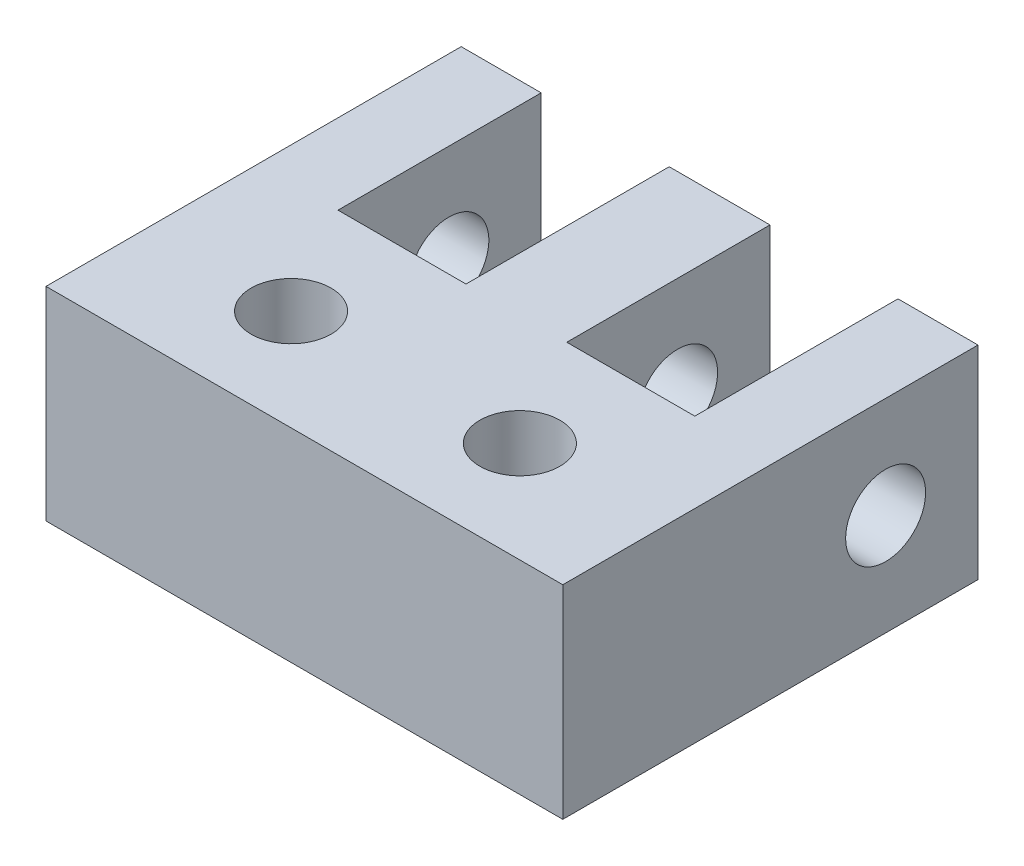
ISO-10303-21;
HEADER;
FILE_DESCRIPTION(('STEP AP214'),'2;1');
FILE_NAME('part.step','',(''),(''),'','','');
FILE_SCHEMA(('AUTOMOTIVE_DESIGN { 1 0 10303 214 1 1 1 1 }'));
ENDSEC;
DATA;
#1=APPLICATION_CONTEXT('core data for automotive mechanical design processes');
#2=APPLICATION_PROTOCOL_DEFINITION('international standard','automotive_design',2000,#1);
#3=PRODUCT_CONTEXT('',#1,'mechanical');
#4=PRODUCT('Part','Part','',(#3));
#5=PRODUCT_RELATED_PRODUCT_CATEGORY('part','',(#4));
#6=PRODUCT_DEFINITION_FORMATION('','',#4);
#7=PRODUCT_DEFINITION_CONTEXT('part definition',#1,'design');
#8=PRODUCT_DEFINITION('design','',#6,#7);
#9=PRODUCT_DEFINITION_SHAPE('','',#8);
#10=(LENGTH_UNIT() NAMED_UNIT(*) SI_UNIT(.MILLI.,.METRE.));
#11=(NAMED_UNIT(*) PLANE_ANGLE_UNIT() SI_UNIT($,.RADIAN.));
#12=(NAMED_UNIT(*) SI_UNIT($,.STERADIAN.) SOLID_ANGLE_UNIT());
#13=UNCERTAINTY_MEASURE_WITH_UNIT(LENGTH_MEASURE(1.E-05),#10,'distance_accuracy_value','');
#14=(GEOMETRIC_REPRESENTATION_CONTEXT(3) GLOBAL_UNCERTAINTY_ASSIGNED_CONTEXT((#13)) GLOBAL_UNIT_ASSIGNED_CONTEXT((#10,
#11,#12)) REPRESENTATION_CONTEXT('',''));
#15=CARTESIAN_POINT('',(0.,0.,0.));
#16=DIRECTION('',(0.,0.,1.));
#17=DIRECTION('',(1.,0.,0.));
#18=AXIS2_PLACEMENT_3D('',#15,#16,#17);
#19=CARTESIAN_POINT('',(0.,6.35,0.));
#20=DIRECTION('',(0.,1.,0.));
#21=DIRECTION('',(0.,0.,1.));
#22=AXIS2_PLACEMENT_3D('',#19,#20,#21);
#23=PLANE('',#22);
#24=CARTESIAN_POINT('',(-3.575,6.35,0.));
#25=DIRECTION('',(0.,1.,0.));
#26=DIRECTION('',(0.,0.,1.));
#27=AXIS2_PLACEMENT_3D('',#24,#25,#26);
#28=CIRCLE('',#27,1.25);
#29=CARTESIAN_POINT('',(-3.575,6.35,1.25));
#30=VERTEX_POINT('',#29);
#31=EDGE_CURVE('E165',#30,#30,#28,.T.);
#32=ORIENTED_EDGE('',*,*,#31,.F.);
#33=EDGE_LOOP('',(#32));
#34=FACE_BOUND('',#33,.T.);
#35=DIRECTION('',(0.,0.,-1.));
#36=VECTOR('',#35,1.);
#37=CARTESIAN_POINT('',(8.075,6.35,-9.8162721333788));
#38=LINE('',#37,#36);
#39=CARTESIAN_POINT('',(8.075,6.35,3.1587278666212));
#40=VERTEX_POINT('',#39);
#41=CARTESIAN_POINT('',(8.075,6.35,-9.8162721333788));
#42=VERTEX_POINT('',#41);
#43=EDGE_CURVE('E184',#40,#42,#38,.T.);
#44=ORIENTED_EDGE('',*,*,#43,.T.);
#45=DIRECTION('',(-1.,0.,0.));
#46=VECTOR('',#45,1.);
#47=CARTESIAN_POINT('',(8.075,6.35,-9.8162721333788));
#48=LINE('',#47,#46);
#49=CARTESIAN_POINT('',(5.575,6.35,-9.8162721333788));
#50=VERTEX_POINT('',#49);
#51=EDGE_CURVE('E112',#42,#50,#48,.T.);
#52=ORIENTED_EDGE('',*,*,#51,.T.);
#53=DIRECTION('',(0.,0.,1.));
#54=VECTOR('',#53,1.);
#55=CARTESIAN_POINT('',(5.575,6.35,-9.8162721333788));
#56=LINE('',#55,#54);
#57=CARTESIAN_POINT('',(5.575,6.35,-3.4662721333788));
#58=VERTEX_POINT('',#57);
#59=EDGE_CURVE('E211',#50,#58,#56,.T.);
#60=ORIENTED_EDGE('',*,*,#59,.T.);
#61=DIRECTION('',(-1.,0.,0.));
#62=VECTOR('',#61,1.);
#63=CARTESIAN_POINT('',(5.575,6.35,-3.4662721333788));
#64=LINE('',#63,#62);
#65=CARTESIAN_POINT('',(1.575,6.35,-3.4662721333788));
#66=VERTEX_POINT('',#65);
#67=EDGE_CURVE('E230',#58,#66,#64,.T.);
#68=ORIENTED_EDGE('',*,*,#67,.T.);
#69=DIRECTION('',(0.,0.,-1.));
#70=VECTOR('',#69,1.);
#71=CARTESIAN_POINT('',(1.575,6.35,-3.4662721333788));
#72=LINE('',#71,#70);
#73=CARTESIAN_POINT('',(1.57499999999999,6.35,-9.8162721333788));
#74=VERTEX_POINT('',#73);
#75=EDGE_CURVE('E227',#66,#74,#72,.T.);
#76=ORIENTED_EDGE('',*,*,#75,.T.);
#77=DIRECTION('',(-1.,0.,0.));
#78=VECTOR('',#77,1.);
#79=CARTESIAN_POINT('',(-1.57499999999999,6.35,-9.8162721333788));
#80=LINE('',#79,#78);
#81=CARTESIAN_POINT('',(-1.57499999999999,6.35,-9.8162721333788));
#82=VERTEX_POINT('',#81);
#83=EDGE_CURVE('E229',#74,#82,#80,.T.);
#84=ORIENTED_EDGE('',*,*,#83,.T.);
#85=DIRECTION('',(0.,0.,1.));
#86=VECTOR('',#85,1.);
#87=CARTESIAN_POINT('',(-1.575,6.35,-3.4662721333788));
#88=LINE('',#87,#86);
#89=CARTESIAN_POINT('',(-1.575,6.35,-3.4662721333788));
#90=VERTEX_POINT('',#89);
#91=EDGE_CURVE('E232',#82,#90,#88,.T.);
#92=ORIENTED_EDGE('',*,*,#91,.T.);
#93=DIRECTION('',(-1.,0.,0.));
#94=VECTOR('',#93,1.);
#95=CARTESIAN_POINT('',(-5.575,6.35,-3.4662721333788));
#96=LINE('',#95,#94);
#97=CARTESIAN_POINT('',(-5.575,6.35,-3.4662721333788));
#98=VERTEX_POINT('',#97);
#99=EDGE_CURVE('E238',#90,#98,#96,.T.);
#100=ORIENTED_EDGE('',*,*,#99,.T.);
#101=DIRECTION('',(0.,0.,-1.));
#102=VECTOR('',#101,1.);
#103=CARTESIAN_POINT('',(-5.575,6.35,-9.8162721333788));
#104=LINE('',#103,#102);
#105=CARTESIAN_POINT('',(-5.575,6.35,-9.8162721333788));
#106=VERTEX_POINT('',#105);
#107=EDGE_CURVE('E143',#98,#106,#104,.T.);
#108=ORIENTED_EDGE('',*,*,#107,.T.);
#109=DIRECTION('',(-1.,0.,0.));
#110=VECTOR('',#109,1.);
#111=CARTESIAN_POINT('',(-8.075,6.35,-9.8162721333788));
#112=LINE('',#111,#110);
#113=CARTESIAN_POINT('',(-8.075,6.35,-9.8162721333788));
#114=VERTEX_POINT('',#113);
#115=EDGE_CURVE('E137',#106,#114,#112,.T.);
#116=ORIENTED_EDGE('',*,*,#115,.T.);
#117=DIRECTION('',(0.,0.,1.));
#118=VECTOR('',#117,1.);
#119=CARTESIAN_POINT('',(-8.075,6.35,-9.8162721333788));
#120=LINE('',#119,#118);
#121=CARTESIAN_POINT('',(-8.075,6.35,3.1587278666212));
#122=VERTEX_POINT('',#121);
#123=EDGE_CURVE('E141',#114,#122,#120,.T.);
#124=ORIENTED_EDGE('',*,*,#123,.T.);
#125=DIRECTION('',(1.,0.,0.));
#126=VECTOR('',#125,1.);
#127=CARTESIAN_POINT('',(-8.075,6.35,3.1587278666212));
#128=LINE('',#127,#126);
#129=EDGE_CURVE('E57',#122,#40,#128,.T.);
#130=ORIENTED_EDGE('',*,*,#129,.T.);
#131=EDGE_LOOP('',(#44,#52,#60,#68,#76,#84,#92,#100,#108,#116,#124,#130));
#132=FACE_BOUND('',#131,.T.);
#133=CARTESIAN_POINT('',(3.575,6.35,0.));
#134=DIRECTION('',(0.,1.,0.));
#135=DIRECTION('',(0.,0.,-1.));
#136=AXIS2_PLACEMENT_3D('',#133,#134,#135);
#137=CIRCLE('',#136,1.25);
#138=CARTESIAN_POINT('',(3.575,6.35,-1.25));
#139=VERTEX_POINT('',#138);
#140=EDGE_CURVE('E316',#139,#139,#137,.T.);
#141=ORIENTED_EDGE('',*,*,#140,.F.);
#142=EDGE_LOOP('',(#141));
#143=FACE_BOUND('',#142,.T.);
#144=ADVANCED_FACE('F40',(#34,#132,#143),#23,.T.);
#145=CARTESIAN_POINT('',(0.,0.,0.));
#146=DIRECTION('',(0.,1.,0.));
#147=DIRECTION('',(0.,0.,1.));
#148=AXIS2_PLACEMENT_3D('',#145,#146,#147);
#149=PLANE('',#148);
#150=DIRECTION('',(0.,0.,-1.));
#151=VECTOR('',#150,1.);
#152=CARTESIAN_POINT('',(8.075,0.,-9.8162721333788));
#153=LINE('',#152,#151);
#154=CARTESIAN_POINT('',(8.075,0.,3.1587278666212));
#155=VERTEX_POINT('',#154);
#156=CARTESIAN_POINT('',(8.075,0.,-9.8162721333788));
#157=VERTEX_POINT('',#156);
#158=EDGE_CURVE('E161',#155,#157,#153,.T.);
#159=ORIENTED_EDGE('',*,*,#158,.F.);
#160=DIRECTION('',(1.,0.,0.));
#161=VECTOR('',#160,1.);
#162=CARTESIAN_POINT('',(-8.075,0.,3.1587278666212));
#163=LINE('',#162,#161);
#164=CARTESIAN_POINT('',(-8.075,0.,3.1587278666212));
#165=VERTEX_POINT('',#164);
#166=EDGE_CURVE('E104',#165,#155,#163,.T.);
#167=ORIENTED_EDGE('',*,*,#166,.F.);
#168=DIRECTION('',(0.,0.,1.));
#169=VECTOR('',#168,1.);
#170=CARTESIAN_POINT('',(-8.075,0.,-9.8162721333788));
#171=LINE('',#170,#169);
#172=CARTESIAN_POINT('',(-8.075,0.,-9.8162721333788));
#173=VERTEX_POINT('',#172);
#174=EDGE_CURVE('E98',#173,#165,#171,.T.);
#175=ORIENTED_EDGE('',*,*,#174,.F.);
#176=DIRECTION('',(-1.,0.,0.));
#177=VECTOR('',#176,1.);
#178=CARTESIAN_POINT('',(-8.075,0.,-9.8162721333788));
#179=LINE('',#178,#177);
#180=CARTESIAN_POINT('',(-5.575,0.,-9.8162721333788));
#181=VERTEX_POINT('',#180);
#182=EDGE_CURVE('E151',#181,#173,#179,.T.);
#183=ORIENTED_EDGE('',*,*,#182,.F.);
#184=DIRECTION('',(0.,0.,-1.));
#185=VECTOR('',#184,1.);
#186=CARTESIAN_POINT('',(-5.575,0.,-9.8162721333788));
#187=LINE('',#186,#185);
#188=CARTESIAN_POINT('',(-5.575,0.,-3.4662721333788));
#189=VERTEX_POINT('',#188);
#190=EDGE_CURVE('E179',#189,#181,#187,.T.);
#191=ORIENTED_EDGE('',*,*,#190,.F.);
#192=DIRECTION('',(-1.,0.,0.));
#193=VECTOR('',#192,1.);
#194=CARTESIAN_POINT('',(-5.575,0.,-3.4662721333788));
#195=LINE('',#194,#193);
#196=CARTESIAN_POINT('',(-1.575,0.,-3.4662721333788));
#197=VERTEX_POINT('',#196);
#198=EDGE_CURVE('E177',#197,#189,#195,.T.);
#199=ORIENTED_EDGE('',*,*,#198,.F.);
#200=DIRECTION('',(0.,0.,1.));
#201=VECTOR('',#200,1.);
#202=CARTESIAN_POINT('',(-1.575,0.,-3.4662721333788));
#203=LINE('',#202,#201);
#204=CARTESIAN_POINT('',(-1.57499999999999,0.,-9.8162721333788));
#205=VERTEX_POINT('',#204);
#206=EDGE_CURVE('E175',#205,#197,#203,.T.);
#207=ORIENTED_EDGE('',*,*,#206,.F.);
#208=DIRECTION('',(-1.,0.,0.));
#209=VECTOR('',#208,1.);
#210=CARTESIAN_POINT('',(-1.57499999999999,0.,-9.8162721333788));
#211=LINE('',#210,#209);
#212=CARTESIAN_POINT('',(1.57499999999999,0.,-9.8162721333788));
#213=VERTEX_POINT('',#212);
#214=EDGE_CURVE('E173',#213,#205,#211,.T.);
#215=ORIENTED_EDGE('',*,*,#214,.F.);
#216=DIRECTION('',(0.,0.,-1.));
#217=VECTOR('',#216,1.);
#218=CARTESIAN_POINT('',(1.575,0.,-3.4662721333788));
#219=LINE('',#218,#217);
#220=CARTESIAN_POINT('',(1.575,0.,-3.4662721333788));
#221=VERTEX_POINT('',#220);
#222=EDGE_CURVE('E171',#221,#213,#219,.T.);
#223=ORIENTED_EDGE('',*,*,#222,.F.);
#224=DIRECTION('',(-1.,0.,0.));
#225=VECTOR('',#224,1.);
#226=CARTESIAN_POINT('',(5.575,0.,-3.4662721333788));
#227=LINE('',#226,#225);
#228=CARTESIAN_POINT('',(5.575,0.,-3.4662721333788));
#229=VERTEX_POINT('',#228);
#230=EDGE_CURVE('E169',#229,#221,#227,.T.);
#231=ORIENTED_EDGE('',*,*,#230,.F.);
#232=DIRECTION('',(0.,0.,1.));
#233=VECTOR('',#232,1.);
#234=CARTESIAN_POINT('',(5.575,0.,-9.8162721333788));
#235=LINE('',#234,#233);
#236=CARTESIAN_POINT('',(5.575,0.,-9.8162721333788));
#237=VERTEX_POINT('',#236);
#238=EDGE_CURVE('E167',#237,#229,#235,.T.);
#239=ORIENTED_EDGE('',*,*,#238,.F.);
#240=DIRECTION('',(-1.,0.,0.));
#241=VECTOR('',#240,1.);
#242=CARTESIAN_POINT('',(8.075,0.,-9.8162721333788));
#243=LINE('',#242,#241);
#244=EDGE_CURVE('E164',#157,#237,#243,.T.);
#245=ORIENTED_EDGE('',*,*,#244,.F.);
#246=EDGE_LOOP('',(#159,#167,#175,#183,#191,#199,#207,#215,#223,#231,#239,#245));
#247=FACE_BOUND('',#246,.T.);
#248=CARTESIAN_POINT('',(-3.575,0.,0.));
#249=DIRECTION('',(0.,1.,0.));
#250=DIRECTION('',(0.,0.,1.));
#251=AXIS2_PLACEMENT_3D('',#248,#249,#250);
#252=CIRCLE('',#251,1.25);
#253=CARTESIAN_POINT('',(-3.575,0.,1.25));
#254=VERTEX_POINT('',#253);
#255=EDGE_CURVE('E319',#254,#254,#252,.T.);
#256=ORIENTED_EDGE('',*,*,#255,.T.);
#257=EDGE_LOOP('',(#256));
#258=FACE_BOUND('',#257,.T.);
#259=CARTESIAN_POINT('',(3.575,0.,0.));
#260=DIRECTION('',(0.,1.,0.));
#261=DIRECTION('',(0.,0.,-1.));
#262=AXIS2_PLACEMENT_3D('',#259,#260,#261);
#263=CIRCLE('',#262,1.25);
#264=CARTESIAN_POINT('',(3.575,0.,-1.25));
#265=VERTEX_POINT('',#264);
#266=EDGE_CURVE('E315',#265,#265,#263,.T.);
#267=ORIENTED_EDGE('',*,*,#266,.T.);
#268=EDGE_LOOP('',(#267));
#269=FACE_BOUND('',#268,.T.);
#270=ADVANCED_FACE('F215',(#247,#258,#269),#149,.F.);
#271=CARTESIAN_POINT('',(8.075,6.35,-9.8162721333788));
#272=DIRECTION('',(-1.,0.,0.));
#273=DIRECTION('',(0.,0.,1.));
#274=AXIS2_PLACEMENT_3D('',#271,#272,#273);
#275=PLANE('',#274);
#276=CARTESIAN_POINT('',(8.075,3.18109801472884,-6.92967359790204));
#277=DIRECTION('',(-1.,0.,0.));
#278=DIRECTION('',(0.,0.,1.));
#279=AXIS2_PLACEMENT_3D('',#276,#277,#278);
#280=CIRCLE('',#279,1.25);
#281=CARTESIAN_POINT('',(8.075,3.18109801472884,-5.67967359790204));
#282=VERTEX_POINT('',#281);
#283=EDGE_CURVE('E301',#282,#282,#280,.T.);
#284=ORIENTED_EDGE('',*,*,#283,.T.);
#285=EDGE_LOOP('',(#284));
#286=FACE_BOUND('',#285,.T.);
#287=ORIENTED_EDGE('',*,*,#158,.T.);
#288=DIRECTION('',(0.,-1.,0.));
#289=VECTOR('',#288,1.);
#290=CARTESIAN_POINT('',(8.075,6.35,-9.8162721333788));
#291=LINE('',#290,#289);
#292=EDGE_CURVE('E11',#42,#157,#291,.T.);
#293=ORIENTED_EDGE('',*,*,#292,.F.);
#294=ORIENTED_EDGE('',*,*,#43,.F.);
#295=DIRECTION('',(0.,-1.,0.));
#296=VECTOR('',#295,1.);
#297=CARTESIAN_POINT('',(8.075,6.35,3.1587278666212));
#298=LINE('',#297,#296);
#299=EDGE_CURVE('E157',#40,#155,#298,.T.);
#300=ORIENTED_EDGE('',*,*,#299,.T.);
#301=EDGE_LOOP('',(#287,#293,#294,#300));
#302=FACE_BOUND('',#301,.T.);
#303=ADVANCED_FACE('F42',(#286,#302),#275,.F.);
#304=CARTESIAN_POINT('',(8.075,6.35,-9.8162721333788));
#305=DIRECTION('',(0.,0.,1.));
#306=DIRECTION('',(1.,0.,0.));
#307=AXIS2_PLACEMENT_3D('',#304,#305,#306);
#308=PLANE('',#307);
#309=ORIENTED_EDGE('',*,*,#244,.T.);
#310=DIRECTION('',(0.,-1.,0.));
#311=VECTOR('',#310,1.);
#312=CARTESIAN_POINT('',(5.575,6.35,-9.8162721333788));
#313=LINE('',#312,#311);
#314=EDGE_CURVE('E49',#50,#237,#313,.T.);
#315=ORIENTED_EDGE('',*,*,#314,.F.);
#316=ORIENTED_EDGE('',*,*,#51,.F.);
#317=ORIENTED_EDGE('',*,*,#292,.T.);
#318=EDGE_LOOP('',(#309,#315,#316,#317));
#319=FACE_BOUND('',#318,.T.);
#320=ADVANCED_FACE('F336',(#319),#308,.F.);
#321=CARTESIAN_POINT('',(5.575,6.35,-9.8162721333788));
#322=DIRECTION('',(1.,0.,0.));
#323=DIRECTION('',(0.,0.,-1.));
#324=AXIS2_PLACEMENT_3D('',#321,#322,#323);
#325=PLANE('',#324);
#326=CARTESIAN_POINT('',(5.575,3.18109801472884,-6.92967359790204));
#327=DIRECTION('',(1.,0.,0.));
#328=DIRECTION('',(0.,0.,-1.));
#329=AXIS2_PLACEMENT_3D('',#326,#327,#328);
#330=CIRCLE('',#329,1.25);
#331=CARTESIAN_POINT('',(5.575,3.18109801472884,-8.17967359790204));
#332=VERTEX_POINT('',#331);
#333=EDGE_CURVE('E312',#332,#332,#330,.T.);
#334=ORIENTED_EDGE('',*,*,#333,.T.);
#335=EDGE_LOOP('',(#334));
#336=FACE_BOUND('',#335,.T.);
#337=ORIENTED_EDGE('',*,*,#238,.T.);
#338=DIRECTION('',(0.,-1.,0.));
#339=VECTOR('',#338,1.);
#340=CARTESIAN_POINT('',(5.575,6.35,-3.4662721333788));
#341=LINE('',#340,#339);
#342=EDGE_CURVE('E203',#58,#229,#341,.T.);
#343=ORIENTED_EDGE('',*,*,#342,.F.);
#344=ORIENTED_EDGE('',*,*,#59,.F.);
#345=ORIENTED_EDGE('',*,*,#314,.T.);
#346=EDGE_LOOP('',(#337,#343,#344,#345));
#347=FACE_BOUND('',#346,.T.);
#348=ADVANCED_FACE('F209',(#336,#347),#325,.F.);
#349=CARTESIAN_POINT('',(5.575,6.35,-3.4662721333788));
#350=DIRECTION('',(0.,0.,1.));
#351=DIRECTION('',(1.,0.,0.));
#352=AXIS2_PLACEMENT_3D('',#349,#350,#351);
#353=PLANE('',#352);
#354=ORIENTED_EDGE('',*,*,#230,.T.);
#355=DIRECTION('',(0.,-1.,0.));
#356=VECTOR('',#355,1.);
#357=CARTESIAN_POINT('',(1.575,6.35,-3.4662721333788));
#358=LINE('',#357,#356);
#359=EDGE_CURVE('E200',#66,#221,#358,.T.);
#360=ORIENTED_EDGE('',*,*,#359,.F.);
#361=ORIENTED_EDGE('',*,*,#67,.F.);
#362=ORIENTED_EDGE('',*,*,#342,.T.);
#363=EDGE_LOOP('',(#354,#360,#361,#362));
#364=FACE_BOUND('',#363,.T.);
#365=ADVANCED_FACE('F221',(#364),#353,.F.);
#366=CARTESIAN_POINT('',(1.575,6.35,-3.4662721333788));
#367=DIRECTION('',(-1.,0.,0.));
#368=DIRECTION('',(0.,0.,1.));
#369=AXIS2_PLACEMENT_3D('',#366,#367,#368);
#370=PLANE('',#369);
#371=CARTESIAN_POINT('',(1.575,3.18109801472884,-6.92967359790204));
#372=DIRECTION('',(-1.,0.,0.));
#373=DIRECTION('',(0.,0.,1.));
#374=AXIS2_PLACEMENT_3D('',#371,#372,#373);
#375=CIRCLE('',#374,1.25);
#376=CARTESIAN_POINT('',(1.575,3.18109801472884,-5.67967359790204));
#377=VERTEX_POINT('',#376);
#378=EDGE_CURVE('E304',#377,#377,#375,.T.);
#379=ORIENTED_EDGE('',*,*,#378,.T.);
#380=EDGE_LOOP('',(#379));
#381=FACE_BOUND('',#380,.T.);
#382=ORIENTED_EDGE('',*,*,#222,.T.);
#383=DIRECTION('',(0.,-1.,0.));
#384=VECTOR('',#383,1.);
#385=CARTESIAN_POINT('',(1.57499999999999,6.35,-9.8162721333788));
#386=LINE('',#385,#384);
#387=EDGE_CURVE('E197',#74,#213,#386,.T.);
#388=ORIENTED_EDGE('',*,*,#387,.F.);
#389=ORIENTED_EDGE('',*,*,#75,.F.);
#390=ORIENTED_EDGE('',*,*,#359,.T.);
#391=EDGE_LOOP('',(#382,#388,#389,#390));
#392=FACE_BOUND('',#391,.T.);
#393=ADVANCED_FACE('F225',(#381,#392),#370,.F.);
#394=CARTESIAN_POINT('',(-1.57499999999999,6.35,-9.8162721333788));
#395=DIRECTION('',(0.,0.,1.));
#396=DIRECTION('',(1.,0.,0.));
#397=AXIS2_PLACEMENT_3D('',#394,#395,#396);
#398=PLANE('',#397);
#399=ORIENTED_EDGE('',*,*,#214,.T.);
#400=DIRECTION('',(0.,-1.,0.));
#401=VECTOR('',#400,1.);
#402=CARTESIAN_POINT('',(-1.57499999999999,6.35,-9.8162721333788));
#403=LINE('',#402,#401);
#404=EDGE_CURVE('E194',#82,#205,#403,.T.);
#405=ORIENTED_EDGE('',*,*,#404,.F.);
#406=ORIENTED_EDGE('',*,*,#83,.F.);
#407=ORIENTED_EDGE('',*,*,#387,.T.);
#408=EDGE_LOOP('',(#399,#405,#406,#407));
#409=FACE_BOUND('',#408,.T.);
#410=ADVANCED_FACE('F346',(#409),#398,.F.);
#411=CARTESIAN_POINT('',(-1.575,6.35,-3.4662721333788));
#412=DIRECTION('',(1.,0.,0.));
#413=DIRECTION('',(0.,0.,-1.));
#414=AXIS2_PLACEMENT_3D('',#411,#412,#413);
#415=PLANE('',#414);
#416=CARTESIAN_POINT('',(-1.575,3.18109801472884,-6.92967359790204));
#417=DIRECTION('',(1.,0.,0.));
#418=DIRECTION('',(0.,0.,-1.));
#419=AXIS2_PLACEMENT_3D('',#416,#417,#418);
#420=CIRCLE('',#419,1.25);
#421=CARTESIAN_POINT('',(-1.575,3.18109801472884,-8.17967359790204));
#422=VERTEX_POINT('',#421);
#423=EDGE_CURVE('E300',#422,#422,#420,.T.);
#424=ORIENTED_EDGE('',*,*,#423,.T.);
#425=EDGE_LOOP('',(#424));
#426=FACE_BOUND('',#425,.T.);
#427=ORIENTED_EDGE('',*,*,#206,.T.);
#428=DIRECTION('',(0.,-1.,0.));
#429=VECTOR('',#428,1.);
#430=CARTESIAN_POINT('',(-1.575,6.35,-3.4662721333788));
#431=LINE('',#430,#429);
#432=EDGE_CURVE('E191',#90,#197,#431,.T.);
#433=ORIENTED_EDGE('',*,*,#432,.F.);
#434=ORIENTED_EDGE('',*,*,#91,.F.);
#435=ORIENTED_EDGE('',*,*,#404,.T.);
#436=EDGE_LOOP('',(#427,#433,#434,#435));
#437=FACE_BOUND('',#436,.T.);
#438=ADVANCED_FACE('F350',(#426,#437),#415,.F.);
#439=CARTESIAN_POINT('',(-5.575,6.35,-3.4662721333788));
#440=DIRECTION('',(0.,0.,1.));
#441=DIRECTION('',(1.,0.,0.));
#442=AXIS2_PLACEMENT_3D('',#439,#440,#441);
#443=PLANE('',#442);
#444=ORIENTED_EDGE('',*,*,#198,.T.);
#445=DIRECTION('',(0.,-1.,0.));
#446=VECTOR('',#445,1.);
#447=CARTESIAN_POINT('',(-5.575,6.35,-3.4662721333788));
#448=LINE('',#447,#446);
#449=EDGE_CURVE('E188',#98,#189,#448,.T.);
#450=ORIENTED_EDGE('',*,*,#449,.F.);
#451=ORIENTED_EDGE('',*,*,#99,.F.);
#452=ORIENTED_EDGE('',*,*,#432,.T.);
#453=EDGE_LOOP('',(#444,#450,#451,#452));
#454=FACE_BOUND('',#453,.T.);
#455=ADVANCED_FACE('F244',(#454),#443,.F.);
#456=CARTESIAN_POINT('',(-5.575,6.35,-9.8162721333788));
#457=DIRECTION('',(-1.,0.,0.));
#458=DIRECTION('',(0.,0.,1.));
#459=AXIS2_PLACEMENT_3D('',#456,#457,#458);
#460=PLANE('',#459);
#461=CARTESIAN_POINT('',(-5.575,3.18109801472884,-6.92967359790204));
#462=DIRECTION('',(-1.,0.,0.));
#463=DIRECTION('',(0.,0.,1.));
#464=AXIS2_PLACEMENT_3D('',#461,#462,#463);
#465=CIRCLE('',#464,1.25);
#466=CARTESIAN_POINT('',(-5.575,3.18109801472884,-5.67967359790204));
#467=VERTEX_POINT('',#466);
#468=EDGE_CURVE('E298',#467,#467,#465,.T.);
#469=ORIENTED_EDGE('',*,*,#468,.T.);
#470=EDGE_LOOP('',(#469));
#471=FACE_BOUND('',#470,.T.);
#472=ORIENTED_EDGE('',*,*,#190,.T.);
#473=DIRECTION('',(0.,-1.,0.));
#474=VECTOR('',#473,1.);
#475=CARTESIAN_POINT('',(-5.575,6.35,-9.8162721333788));
#476=LINE('',#475,#474);
#477=EDGE_CURVE('E152',#106,#181,#476,.T.);
#478=ORIENTED_EDGE('',*,*,#477,.F.);
#479=ORIENTED_EDGE('',*,*,#107,.F.);
#480=ORIENTED_EDGE('',*,*,#449,.T.);
#481=EDGE_LOOP('',(#472,#478,#479,#480));
#482=FACE_BOUND('',#481,.T.);
#483=ADVANCED_FACE('F248',(#471,#482),#460,.F.);
#484=CARTESIAN_POINT('',(-8.075,6.35,-9.8162721333788));
#485=DIRECTION('',(0.,0.,1.));
#486=DIRECTION('',(1.,0.,0.));
#487=AXIS2_PLACEMENT_3D('',#484,#485,#486);
#488=PLANE('',#487);
#489=ORIENTED_EDGE('',*,*,#182,.T.);
#490=DIRECTION('',(0.,-1.,0.));
#491=VECTOR('',#490,1.);
#492=CARTESIAN_POINT('',(-8.075,6.35,-9.8162721333788));
#493=LINE('',#492,#491);
#494=EDGE_CURVE('E148',#114,#173,#493,.T.);
#495=ORIENTED_EDGE('',*,*,#494,.F.);
#496=ORIENTED_EDGE('',*,*,#115,.F.);
#497=ORIENTED_EDGE('',*,*,#477,.T.);
#498=EDGE_LOOP('',(#489,#495,#496,#497));
#499=FACE_BOUND('',#498,.T.);
#500=ADVANCED_FACE('F149',(#499),#488,.F.);
#501=CARTESIAN_POINT('',(-8.075,6.35,-9.8162721333788));
#502=DIRECTION('',(1.,0.,0.));
#503=DIRECTION('',(0.,0.,-1.));
#504=AXIS2_PLACEMENT_3D('',#501,#502,#503);
#505=PLANE('',#504);
#506=CARTESIAN_POINT('',(-8.075,3.18109801472884,-6.92967359790204));
#507=DIRECTION('',(-1.,0.,0.));
#508=DIRECTION('',(0.,0.,1.));
#509=AXIS2_PLACEMENT_3D('',#506,#507,#508);
#510=CIRCLE('',#509,1.25);
#511=CARTESIAN_POINT('',(-8.075,3.18109801472884,-5.67967359790204));
#512=VERTEX_POINT('',#511);
#513=EDGE_CURVE('E295',#512,#512,#510,.T.);
#514=ORIENTED_EDGE('',*,*,#513,.F.);
#515=EDGE_LOOP('',(#514));
#516=FACE_BOUND('',#515,.T.);
#517=ORIENTED_EDGE('',*,*,#174,.T.);
#518=DIRECTION('',(0.,-1.,0.));
#519=VECTOR('',#518,1.);
#520=CARTESIAN_POINT('',(-8.075,6.35,3.1587278666212));
#521=LINE('',#520,#519);
#522=EDGE_CURVE('E153',#122,#165,#521,.T.);
#523=ORIENTED_EDGE('',*,*,#522,.F.);
#524=ORIENTED_EDGE('',*,*,#123,.F.);
#525=ORIENTED_EDGE('',*,*,#494,.T.);
#526=EDGE_LOOP('',(#517,#523,#524,#525));
#527=FACE_BOUND('',#526,.T.);
#528=ADVANCED_FACE('F155',(#516,#527),#505,.F.);
#529=CARTESIAN_POINT('',(-8.075,6.35,3.1587278666212));
#530=DIRECTION('',(0.,0.,-1.));
#531=DIRECTION('',(-1.,0.,0.));
#532=AXIS2_PLACEMENT_3D('',#529,#530,#531);
#533=PLANE('',#532);
#534=ORIENTED_EDGE('',*,*,#166,.T.);
#535=ORIENTED_EDGE('',*,*,#299,.F.);
#536=ORIENTED_EDGE('',*,*,#129,.F.);
#537=ORIENTED_EDGE('',*,*,#522,.T.);
#538=EDGE_LOOP('',(#534,#535,#536,#537));
#539=FACE_BOUND('',#538,.T.);
#540=ADVANCED_FACE('F252',(#539),#533,.F.);
#541=CARTESIAN_POINT('',(-3.575,6.35,0.));
#542=DIRECTION('',(0.,-1.,0.));
#543=DIRECTION('',(0.,0.,-1.));
#544=AXIS2_PLACEMENT_3D('',#541,#542,#543);
#545=CYLINDRICAL_SURFACE('',#544,1.25);
#546=ORIENTED_EDGE('',*,*,#31,.T.);
#547=EDGE_LOOP('',(#546));
#548=FACE_BOUND('',#547,.T.);
#549=ORIENTED_EDGE('',*,*,#255,.F.);
#550=EDGE_LOOP('',(#549));
#551=FACE_BOUND('',#550,.T.);
#552=ADVANCED_FACE('F254',(#548,#551),#545,.F.);
#553=CARTESIAN_POINT('',(3.575,6.35,0.));
#554=DIRECTION('',(0.,-1.,0.));
#555=DIRECTION('',(0.,0.,-1.));
#556=AXIS2_PLACEMENT_3D('',#553,#554,#555);
#557=CYLINDRICAL_SURFACE('',#556,1.25);
#558=ORIENTED_EDGE('',*,*,#140,.T.);
#559=EDGE_LOOP('',(#558));
#560=FACE_BOUND('',#559,.T.);
#561=ORIENTED_EDGE('',*,*,#266,.F.);
#562=EDGE_LOOP('',(#561));
#563=FACE_BOUND('',#562,.T.);
#564=ADVANCED_FACE('F260',(#560,#563),#557,.F.);
#565=CARTESIAN_POINT('',(8.075,3.18109801472884,-6.92967359790204));
#566=DIRECTION('',(-1.,0.,0.));
#567=DIRECTION('',(0.,0.,1.));
#568=AXIS2_PLACEMENT_3D('',#565,#566,#567);
#569=CYLINDRICAL_SURFACE('',#568,1.25);
#570=ORIENTED_EDGE('',*,*,#513,.T.);
#571=EDGE_LOOP('',(#570));
#572=FACE_BOUND('',#571,.T.);
#573=ORIENTED_EDGE('',*,*,#468,.F.);
#574=EDGE_LOOP('',(#573));
#575=FACE_BOUND('',#574,.T.);
#576=ADVANCED_FACE('F276',(#572,#575),#569,.F.);
#577=ORIENTED_EDGE('',*,*,#423,.F.);
#578=EDGE_LOOP('',(#577));
#579=FACE_BOUND('',#578,.T.);
#580=ORIENTED_EDGE('',*,*,#378,.F.);
#581=EDGE_LOOP('',(#580));
#582=FACE_BOUND('',#581,.T.);
#583=ADVANCED_FACE('F280',(#579,#582),#569,.F.);
#584=ORIENTED_EDGE('',*,*,#283,.F.);
#585=EDGE_LOOP('',(#584));
#586=FACE_BOUND('',#585,.T.);
#587=ORIENTED_EDGE('',*,*,#333,.F.);
#588=EDGE_LOOP('',(#587));
#589=FACE_BOUND('',#588,.T.);
#590=ADVANCED_FACE('F278',(#586,#589),#569,.F.);
#591=CLOSED_SHELL('',(#144,#270,#303,#320,#348,#365,#393,#410,#438,#455,#483,#500,#528,#540,
#552,#564,#576,#583,#590));
#592=MANIFOLD_SOLID_BREP('B2',#591);
#593=ADVANCED_BREP_SHAPE_REPRESENTATION('',(#18,#592),#14);
#594=SHAPE_DEFINITION_REPRESENTATION(#9,#593);
ENDSEC;
END-ISO-10303-21;
